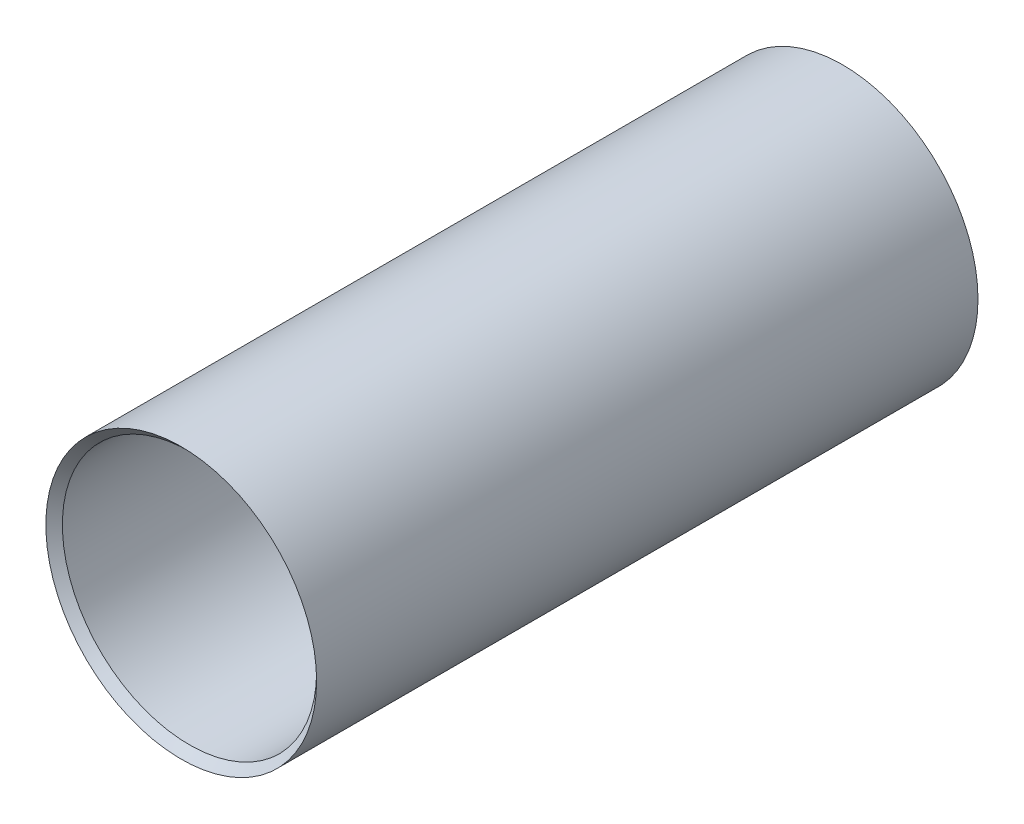
ISO-10303-21;
HEADER;
FILE_DESCRIPTION(('STEP AP214'),'2;1');
FILE_NAME('part.step','',(''),(''),'','','');
FILE_SCHEMA(('AUTOMOTIVE_DESIGN { 1 0 10303 214 1 1 1 1 }'));
ENDSEC;
DATA;
#1=APPLICATION_CONTEXT('core data for automotive mechanical design processes');
#2=APPLICATION_PROTOCOL_DEFINITION('international standard','automotive_design',2000,#1);
#3=PRODUCT_CONTEXT('',#1,'mechanical');
#4=PRODUCT('Part','Part','',(#3));
#5=PRODUCT_RELATED_PRODUCT_CATEGORY('part','',(#4));
#6=PRODUCT_DEFINITION_FORMATION('','',#4);
#7=PRODUCT_DEFINITION_CONTEXT('part definition',#1,'design');
#8=PRODUCT_DEFINITION('design','',#6,#7);
#9=PRODUCT_DEFINITION_SHAPE('','',#8);
#10=(LENGTH_UNIT() NAMED_UNIT(*) SI_UNIT(.MILLI.,.METRE.));
#11=(NAMED_UNIT(*) PLANE_ANGLE_UNIT() SI_UNIT($,.RADIAN.));
#12=(NAMED_UNIT(*) SI_UNIT($,.STERADIAN.) SOLID_ANGLE_UNIT());
#13=UNCERTAINTY_MEASURE_WITH_UNIT(LENGTH_MEASURE(1.E-05),#10,'distance_accuracy_value','');
#14=(GEOMETRIC_REPRESENTATION_CONTEXT(3) GLOBAL_UNCERTAINTY_ASSIGNED_CONTEXT((#13)) GLOBAL_UNIT_ASSIGNED_CONTEXT((#10,
#11,#12)) REPRESENTATION_CONTEXT('',''));
#15=CARTESIAN_POINT('',(0.,0.,0.));
#16=DIRECTION('',(0.,0.,1.));
#17=DIRECTION('',(1.,0.,0.));
#18=AXIS2_PLACEMENT_3D('',#15,#16,#17);
#19=CARTESIAN_POINT('',(0.,0.,-80.75));
#20=DIRECTION('',(0.,0.,1.));
#21=DIRECTION('',(1.,0.,0.));
#22=AXIS2_PLACEMENT_3D('',#19,#20,#21);
#23=CYLINDRICAL_SURFACE('',#22,32.75);
#24=CARTESIAN_POINT('',(0.,0.,-80.75));
#25=DIRECTION('',(0.,0.,1.));
#26=DIRECTION('',(1.,0.,0.));
#27=AXIS2_PLACEMENT_3D('',#24,#25,#26);
#28=CIRCLE('',#27,32.75);
#29=CARTESIAN_POINT('',(32.75,0.,-80.75));
#30=VERTEX_POINT('',#29);
#31=EDGE_CURVE('E45',#30,#30,#28,.T.);
#32=ORIENTED_EDGE('',*,*,#31,.T.);
#33=EDGE_LOOP('',(#32));
#34=FACE_BOUND('',#33,.T.);
#35=CARTESIAN_POINT('',(0.,0.,79.25));
#36=DIRECTION('',(0.,0.,1.));
#37=DIRECTION('',(1.,0.,0.));
#38=AXIS2_PLACEMENT_3D('',#35,#36,#37);
#39=CIRCLE('',#38,32.75);
#40=CARTESIAN_POINT('',(32.75,0.,79.25));
#41=VERTEX_POINT('',#40);
#42=EDGE_CURVE('E59',#41,#41,#39,.F.);
#43=ORIENTED_EDGE('',*,*,#42,.T.);
#44=EDGE_LOOP('',(#43));
#45=FACE_BOUND('',#44,.T.);
#46=ADVANCED_FACE('F37',(#34,#45),#23,.T.);
#47=CARTESIAN_POINT('',(0.,0.,-80.75));
#48=DIRECTION('',(0.,0.,1.));
#49=DIRECTION('',(1.,0.,0.));
#50=AXIS2_PLACEMENT_3D('',#47,#48,#49);
#51=PLANE('',#50);
#52=CARTESIAN_POINT('',(0.,-21.,-80.75));
#53=DIRECTION('',(0.,0.,-1.));
#54=DIRECTION('',(0.,-1.,0.));
#55=AXIS2_PLACEMENT_3D('',#52,#53,#54);
#56=CIRCLE('',#55,3.);
#57=CARTESIAN_POINT('',(0.,-24.,-80.75));
#58=VERTEX_POINT('',#57);
#59=EDGE_CURVE('E112',#58,#58,#56,.T.);
#60=ORIENTED_EDGE('',*,*,#59,.F.);
#61=EDGE_LOOP('',(#60));
#62=FACE_BOUND('',#61,.T.);
#63=CARTESIAN_POINT('',(21.,0.,-80.75));
#64=DIRECTION('',(0.,0.,-1.));
#65=DIRECTION('',(1.,0.,0.));
#66=AXIS2_PLACEMENT_3D('',#63,#64,#65);
#67=CIRCLE('',#66,3.);
#68=CARTESIAN_POINT('',(24.,0.,-80.75));
#69=VERTEX_POINT('',#68);
#70=EDGE_CURVE('E120',#69,#69,#67,.T.);
#71=ORIENTED_EDGE('',*,*,#70,.F.);
#72=EDGE_LOOP('',(#71));
#73=FACE_BOUND('',#72,.T.);
#74=CARTESIAN_POINT('',(-2.19963324347117E-13,21.,-80.75));
#75=DIRECTION('',(0.,0.,-1.));
#76=DIRECTION('',(0.,1.,0.));
#77=AXIS2_PLACEMENT_3D('',#74,#75,#76);
#78=CIRCLE('',#77,3.);
#79=CARTESIAN_POINT('',(-2.51386656396706E-13,24.,-80.75));
#80=VERTEX_POINT('',#79);
#81=EDGE_CURVE('E62',#80,#80,#78,.T.);
#82=ORIENTED_EDGE('',*,*,#81,.F.);
#83=EDGE_LOOP('',(#82));
#84=FACE_BOUND('',#83,.T.);
#85=CARTESIAN_POINT('',(-21.,0.,-80.75));
#86=DIRECTION('',(0.,0.,-1.));
#87=DIRECTION('',(-1.,0.,0.));
#88=AXIS2_PLACEMENT_3D('',#85,#86,#87);
#89=CIRCLE('',#88,3.);
#90=CARTESIAN_POINT('',(-24.,0.,-80.75));
#91=VERTEX_POINT('',#90);
#92=EDGE_CURVE('E56',#91,#91,#89,.T.);
#93=ORIENTED_EDGE('',*,*,#92,.F.);
#94=EDGE_LOOP('',(#93));
#95=FACE_BOUND('',#94,.T.);
#96=ORIENTED_EDGE('',*,*,#31,.F.);
#97=EDGE_LOOP('',(#96));
#98=FACE_BOUND('',#97,.T.);
#99=ADVANCED_FACE('F137',(#62,#73,#84,#95,#98),#51,.F.);
#100=CARTESIAN_POINT('',(-21.,0.,-70.75));
#101=DIRECTION('',(0.,0.,-1.));
#102=DIRECTION('',(-1.,0.,0.));
#103=AXIS2_PLACEMENT_3D('',#100,#101,#102);
#104=CYLINDRICAL_SURFACE('',#103,3.);
#105=CARTESIAN_POINT('',(-21.,0.,-70.75));
#106=DIRECTION('',(0.,0.,-1.));
#107=DIRECTION('',(-1.,0.,0.));
#108=AXIS2_PLACEMENT_3D('',#105,#106,#107);
#109=CIRCLE('',#108,3.);
#110=CARTESIAN_POINT('',(-24.,0.,-70.75));
#111=VERTEX_POINT('',#110);
#112=EDGE_CURVE('E50',#111,#111,#109,.T.);
#113=ORIENTED_EDGE('',*,*,#112,.F.);
#114=EDGE_LOOP('',(#113));
#115=FACE_BOUND('',#114,.T.);
#116=ORIENTED_EDGE('',*,*,#92,.T.);
#117=EDGE_LOOP('',(#116));
#118=FACE_BOUND('',#117,.T.);
#119=ADVANCED_FACE('F140',(#115,#118),#104,.F.);
#120=CARTESIAN_POINT('',(-21.,0.,-70.75));
#121=DIRECTION('',(0.,0.,-1.));
#122=DIRECTION('',(-1.,0.,0.));
#123=AXIS2_PLACEMENT_3D('',#120,#121,#122);
#124=PLANE('',#123);
#125=ORIENTED_EDGE('',*,*,#112,.T.);
#126=EDGE_LOOP('',(#125));
#127=FACE_BOUND('',#126,.T.);
#128=ADVANCED_FACE('F133',(#127),#124,.T.);
#129=CARTESIAN_POINT('',(-2.19963324347117E-13,21.,-70.75));
#130=DIRECTION('',(0.,0.,-1.));
#131=DIRECTION('',(-1.,0.,0.));
#132=AXIS2_PLACEMENT_3D('',#129,#130,#131);
#133=CYLINDRICAL_SURFACE('',#132,3.);
#134=CARTESIAN_POINT('',(-2.19963324347117E-13,21.,-70.75));
#135=DIRECTION('',(0.,0.,-1.));
#136=DIRECTION('',(0.,1.,0.));
#137=AXIS2_PLACEMENT_3D('',#134,#135,#136);
#138=CIRCLE('',#137,3.);
#139=CARTESIAN_POINT('',(-2.51386656396706E-13,24.,-70.75));
#140=VERTEX_POINT('',#139);
#141=EDGE_CURVE('E69',#140,#140,#138,.T.);
#142=ORIENTED_EDGE('',*,*,#141,.F.);
#143=EDGE_LOOP('',(#142));
#144=FACE_BOUND('',#143,.T.);
#145=ORIENTED_EDGE('',*,*,#81,.T.);
#146=EDGE_LOOP('',(#145));
#147=FACE_BOUND('',#146,.T.);
#148=ADVANCED_FACE('F130',(#144,#147),#133,.F.);
#149=CARTESIAN_POINT('',(-2.19963324347117E-13,21.,-70.75));
#150=DIRECTION('',(0.,0.,-1.));
#151=DIRECTION('',(0.,1.,0.));
#152=AXIS2_PLACEMENT_3D('',#149,#150,#151);
#153=PLANE('',#152);
#154=ORIENTED_EDGE('',*,*,#141,.T.);
#155=EDGE_LOOP('',(#154));
#156=FACE_BOUND('',#155,.T.);
#157=ADVANCED_FACE('F128',(#156),#153,.T.);
#158=CARTESIAN_POINT('',(21.,0.,-70.75));
#159=DIRECTION('',(0.,0.,-1.));
#160=DIRECTION('',(-1.,0.,0.));
#161=AXIS2_PLACEMENT_3D('',#158,#159,#160);
#162=CYLINDRICAL_SURFACE('',#161,3.);
#163=CARTESIAN_POINT('',(21.,0.,-70.75));
#164=DIRECTION('',(0.,0.,-1.));
#165=DIRECTION('',(1.,0.,0.));
#166=AXIS2_PLACEMENT_3D('',#163,#164,#165);
#167=CIRCLE('',#166,3.);
#168=CARTESIAN_POINT('',(24.,0.,-70.75));
#169=VERTEX_POINT('',#168);
#170=EDGE_CURVE('E116',#169,#169,#167,.T.);
#171=ORIENTED_EDGE('',*,*,#170,.F.);
#172=EDGE_LOOP('',(#171));
#173=FACE_BOUND('',#172,.T.);
#174=ORIENTED_EDGE('',*,*,#70,.T.);
#175=EDGE_LOOP('',(#174));
#176=FACE_BOUND('',#175,.T.);
#177=ADVANCED_FACE('F185',(#173,#176),#162,.F.);
#178=CARTESIAN_POINT('',(21.,0.,-70.75));
#179=DIRECTION('',(0.,0.,-1.));
#180=DIRECTION('',(1.,0.,0.));
#181=AXIS2_PLACEMENT_3D('',#178,#179,#180);
#182=PLANE('',#181);
#183=ORIENTED_EDGE('',*,*,#170,.T.);
#184=EDGE_LOOP('',(#183));
#185=FACE_BOUND('',#184,.T.);
#186=ADVANCED_FACE('F194',(#185),#182,.T.);
#187=CARTESIAN_POINT('',(0.,-21.,-70.75));
#188=DIRECTION('',(0.,0.,-1.));
#189=DIRECTION('',(-1.,0.,0.));
#190=AXIS2_PLACEMENT_3D('',#187,#188,#189);
#191=CYLINDRICAL_SURFACE('',#190,3.);
#192=CARTESIAN_POINT('',(0.,-21.,-70.75));
#193=DIRECTION('',(0.,0.,-1.));
#194=DIRECTION('',(0.,-1.,0.));
#195=AXIS2_PLACEMENT_3D('',#192,#193,#194);
#196=CIRCLE('',#195,3.);
#197=CARTESIAN_POINT('',(0.,-24.,-70.75));
#198=VERTEX_POINT('',#197);
#199=EDGE_CURVE('E108',#198,#198,#196,.T.);
#200=ORIENTED_EDGE('',*,*,#199,.F.);
#201=EDGE_LOOP('',(#200));
#202=FACE_BOUND('',#201,.T.);
#203=ORIENTED_EDGE('',*,*,#59,.T.);
#204=EDGE_LOOP('',(#203));
#205=FACE_BOUND('',#204,.T.);
#206=ADVANCED_FACE('F204',(#202,#205),#191,.F.);
#207=CARTESIAN_POINT('',(0.,-21.,-70.75));
#208=DIRECTION('',(0.,0.,-1.));
#209=DIRECTION('',(0.,-1.,0.));
#210=AXIS2_PLACEMENT_3D('',#207,#208,#209);
#211=PLANE('',#210);
#212=ORIENTED_EDGE('',*,*,#199,.T.);
#213=EDGE_LOOP('',(#212));
#214=FACE_BOUND('',#213,.T.);
#215=ADVANCED_FACE('F213',(#214),#211,.T.);
#216=CARTESIAN_POINT('',(0.,0.,-80.75));
#217=DIRECTION('',(0.,0.,1.));
#218=DIRECTION('',(1.,0.,0.));
#219=AXIS2_PLACEMENT_3D('',#216,#217,#218);
#220=CYLINDRICAL_SURFACE('',#219,30.75);
#221=CARTESIAN_POINT('',(0.,0.,77.25));
#222=DIRECTION('',(0.,0.,1.));
#223=DIRECTION('',(1.,0.,0.));
#224=AXIS2_PLACEMENT_3D('',#221,#222,#223);
#225=CIRCLE('',#224,30.75);
#226=CARTESIAN_POINT('',(30.75,0.,77.25));
#227=VERTEX_POINT('',#226);
#228=EDGE_CURVE('E10',#227,#227,#225,.T.);
#229=ORIENTED_EDGE('',*,*,#228,.T.);
#230=EDGE_LOOP('',(#229));
#231=FACE_BOUND('',#230,.T.);
#232=CARTESIAN_POINT('',(0.,0.,-78.75));
#233=DIRECTION('',(0.,0.,1.));
#234=DIRECTION('',(1.,0.,0.));
#235=AXIS2_PLACEMENT_3D('',#232,#233,#234);
#236=CIRCLE('',#235,30.75);
#237=CARTESIAN_POINT('',(30.75,0.,-78.75));
#238=VERTEX_POINT('',#237);
#239=EDGE_CURVE('E63',#238,#238,#236,.T.);
#240=ORIENTED_EDGE('',*,*,#239,.F.);
#241=EDGE_LOOP('',(#240));
#242=FACE_BOUND('',#241,.T.);
#243=ADVANCED_FACE('F222',(#231,#242),#220,.F.);
#244=CARTESIAN_POINT('',(0.,0.,-78.75));
#245=DIRECTION('',(0.,0.,1.));
#246=DIRECTION('',(1.,0.,0.));
#247=AXIS2_PLACEMENT_3D('',#244,#245,#246);
#248=PLANE('',#247);
#249=CARTESIAN_POINT('',(0.,-21.,-78.75));
#250=DIRECTION('',(0.,0.,1.));
#251=DIRECTION('',(1.,0.,0.));
#252=AXIS2_PLACEMENT_3D('',#249,#250,#251);
#253=CIRCLE('',#252,5.);
#254=CARTESIAN_POINT('',(5.00000000000007,-21.,-78.75));
#255=VERTEX_POINT('',#254);
#256=EDGE_CURVE('E81',#255,#255,#253,.F.);
#257=ORIENTED_EDGE('',*,*,#256,.T.);
#258=EDGE_LOOP('',(#257));
#259=FACE_BOUND('',#258,.T.);
#260=CARTESIAN_POINT('',(21.,0.,-78.75));
#261=DIRECTION('',(0.,0.,1.));
#262=DIRECTION('',(1.,0.,0.));
#263=AXIS2_PLACEMENT_3D('',#260,#261,#262);
#264=CIRCLE('',#263,5.);
#265=CARTESIAN_POINT('',(26.,0.,-78.75));
#266=VERTEX_POINT('',#265);
#267=EDGE_CURVE('E87',#266,#266,#264,.F.);
#268=ORIENTED_EDGE('',*,*,#267,.T.);
#269=EDGE_LOOP('',(#268));
#270=FACE_BOUND('',#269,.T.);
#271=CARTESIAN_POINT('',(-2.19963324347117E-13,21.,-78.75));
#272=DIRECTION('',(0.,0.,1.));
#273=DIRECTION('',(1.,0.,0.));
#274=AXIS2_PLACEMENT_3D('',#271,#272,#273);
#275=CIRCLE('',#274,5.);
#276=CARTESIAN_POINT('',(4.99999999999978,21.,-78.75));
#277=VERTEX_POINT('',#276);
#278=EDGE_CURVE('E92',#277,#277,#275,.F.);
#279=ORIENTED_EDGE('',*,*,#278,.T.);
#280=EDGE_LOOP('',(#279));
#281=FACE_BOUND('',#280,.T.);
#282=CARTESIAN_POINT('',(-21.,0.,-78.75));
#283=DIRECTION('',(0.,0.,1.));
#284=DIRECTION('',(1.,0.,0.));
#285=AXIS2_PLACEMENT_3D('',#282,#283,#284);
#286=CIRCLE('',#285,5.);
#287=CARTESIAN_POINT('',(-16.,0.,-78.75));
#288=VERTEX_POINT('',#287);
#289=EDGE_CURVE('E78',#288,#288,#286,.F.);
#290=ORIENTED_EDGE('',*,*,#289,.T.);
#291=EDGE_LOOP('',(#290));
#292=FACE_BOUND('',#291,.T.);
#293=ORIENTED_EDGE('',*,*,#239,.T.);
#294=EDGE_LOOP('',(#293));
#295=FACE_BOUND('',#294,.T.);
#296=ADVANCED_FACE('F232',(#259,#270,#281,#292,#295),#248,.T.);
#297=CARTESIAN_POINT('',(-21.,0.,-70.75));
#298=DIRECTION('',(0.,0.,-1.));
#299=DIRECTION('',(-1.,0.,0.));
#300=AXIS2_PLACEMENT_3D('',#297,#298,#299);
#301=CYLINDRICAL_SURFACE('',#300,5.);
#302=CARTESIAN_POINT('',(-21.,0.,-68.75));
#303=DIRECTION('',(0.,0.,-1.));
#304=DIRECTION('',(-1.,0.,0.));
#305=AXIS2_PLACEMENT_3D('',#302,#303,#304);
#306=CIRCLE('',#305,5.);
#307=CARTESIAN_POINT('',(-26.,0.,-68.75));
#308=VERTEX_POINT('',#307);
#309=EDGE_CURVE('E72',#308,#308,#306,.T.);
#310=ORIENTED_EDGE('',*,*,#309,.T.);
#311=EDGE_LOOP('',(#310));
#312=FACE_BOUND('',#311,.T.);
#313=ORIENTED_EDGE('',*,*,#289,.F.);
#314=EDGE_LOOP('',(#313));
#315=FACE_BOUND('',#314,.T.);
#316=ADVANCED_FACE('F240',(#312,#315),#301,.T.);
#317=CARTESIAN_POINT('',(-21.,0.,-68.75));
#318=DIRECTION('',(0.,0.,-1.));
#319=DIRECTION('',(-1.,0.,0.));
#320=AXIS2_PLACEMENT_3D('',#317,#318,#319);
#321=PLANE('',#320);
#322=ORIENTED_EDGE('',*,*,#309,.F.);
#323=EDGE_LOOP('',(#322));
#324=FACE_BOUND('',#323,.T.);
#325=ADVANCED_FACE('F248',(#324),#321,.F.);
#326=CARTESIAN_POINT('',(-2.19963324347117E-13,21.,-70.75));
#327=DIRECTION('',(0.,0.,-1.));
#328=DIRECTION('',(-1.,0.,0.));
#329=AXIS2_PLACEMENT_3D('',#326,#327,#328);
#330=CYLINDRICAL_SURFACE('',#329,5.);
#331=CARTESIAN_POINT('',(-2.19963324347117E-13,21.,-68.75));
#332=DIRECTION('',(0.,0.,-1.));
#333=DIRECTION('',(-1.,0.,0.));
#334=AXIS2_PLACEMENT_3D('',#331,#332,#333);
#335=CIRCLE('',#334,5.);
#336=CARTESIAN_POINT('',(-5.00000000000022,21.,-68.75));
#337=VERTEX_POINT('',#336);
#338=EDGE_CURVE('E91',#337,#337,#335,.T.);
#339=ORIENTED_EDGE('',*,*,#338,.T.);
#340=EDGE_LOOP('',(#339));
#341=FACE_BOUND('',#340,.T.);
#342=ORIENTED_EDGE('',*,*,#278,.F.);
#343=EDGE_LOOP('',(#342));
#344=FACE_BOUND('',#343,.T.);
#345=ADVANCED_FACE('F256',(#341,#344),#330,.T.);
#346=CARTESIAN_POINT('',(-2.19963324347117E-13,21.,-68.75));
#347=DIRECTION('',(0.,0.,-1.));
#348=DIRECTION('',(0.,1.,0.));
#349=AXIS2_PLACEMENT_3D('',#346,#347,#348);
#350=PLANE('',#349);
#351=ORIENTED_EDGE('',*,*,#338,.F.);
#352=EDGE_LOOP('',(#351));
#353=FACE_BOUND('',#352,.T.);
#354=ADVANCED_FACE('F264',(#353),#350,.F.);
#355=CARTESIAN_POINT('',(21.,0.,-70.75));
#356=DIRECTION('',(0.,0.,-1.));
#357=DIRECTION('',(-1.,0.,0.));
#358=AXIS2_PLACEMENT_3D('',#355,#356,#357);
#359=CYLINDRICAL_SURFACE('',#358,5.);
#360=CARTESIAN_POINT('',(21.,0.,-68.75));
#361=DIRECTION('',(0.,0.,-1.));
#362=DIRECTION('',(-1.,0.,0.));
#363=AXIS2_PLACEMENT_3D('',#360,#361,#362);
#364=CIRCLE('',#363,5.);
#365=CARTESIAN_POINT('',(16.,0.,-68.75));
#366=VERTEX_POINT('',#365);
#367=EDGE_CURVE('E86',#366,#366,#364,.T.);
#368=ORIENTED_EDGE('',*,*,#367,.T.);
#369=EDGE_LOOP('',(#368));
#370=FACE_BOUND('',#369,.T.);
#371=ORIENTED_EDGE('',*,*,#267,.F.);
#372=EDGE_LOOP('',(#371));
#373=FACE_BOUND('',#372,.T.);
#374=ADVANCED_FACE('F272',(#370,#373),#359,.T.);
#375=CARTESIAN_POINT('',(21.,0.,-68.75));
#376=DIRECTION('',(0.,0.,-1.));
#377=DIRECTION('',(1.,0.,0.));
#378=AXIS2_PLACEMENT_3D('',#375,#376,#377);
#379=PLANE('',#378);
#380=ORIENTED_EDGE('',*,*,#367,.F.);
#381=EDGE_LOOP('',(#380));
#382=FACE_BOUND('',#381,.T.);
#383=ADVANCED_FACE('F280',(#382),#379,.F.);
#384=CARTESIAN_POINT('',(0.,-21.,-70.75));
#385=DIRECTION('',(0.,0.,-1.));
#386=DIRECTION('',(-1.,0.,0.));
#387=AXIS2_PLACEMENT_3D('',#384,#385,#386);
#388=CYLINDRICAL_SURFACE('',#387,5.);
#389=CARTESIAN_POINT('',(0.,-21.,-68.75));
#390=DIRECTION('',(0.,0.,-1.));
#391=DIRECTION('',(-1.,0.,0.));
#392=AXIS2_PLACEMENT_3D('',#389,#390,#391);
#393=CIRCLE('',#392,5.);
#394=CARTESIAN_POINT('',(-4.99999999999992,-21.,-68.75));
#395=VERTEX_POINT('',#394);
#396=EDGE_CURVE('E85',#395,#395,#393,.T.);
#397=ORIENTED_EDGE('',*,*,#396,.T.);
#398=EDGE_LOOP('',(#397));
#399=FACE_BOUND('',#398,.T.);
#400=ORIENTED_EDGE('',*,*,#256,.F.);
#401=EDGE_LOOP('',(#400));
#402=FACE_BOUND('',#401,.T.);
#403=ADVANCED_FACE('F288',(#399,#402),#388,.T.);
#404=CARTESIAN_POINT('',(0.,-21.,-68.75));
#405=DIRECTION('',(0.,0.,-1.));
#406=DIRECTION('',(0.,-1.,0.));
#407=AXIS2_PLACEMENT_3D('',#404,#405,#406);
#408=PLANE('',#407);
#409=ORIENTED_EDGE('',*,*,#396,.F.);
#410=EDGE_LOOP('',(#409));
#411=FACE_BOUND('',#410,.T.);
#412=ADVANCED_FACE('F296',(#411),#408,.F.);
#413=CARTESIAN_POINT('',(0.,0.,79.25));
#414=DIRECTION('',(0.,0.,1.));
#415=DIRECTION('',(1.,0.,0.));
#416=AXIS2_PLACEMENT_3D('',#413,#414,#415);
#417=CONICAL_SURFACE('',#416,32.75,0.785398163397443);
#418=ORIENTED_EDGE('',*,*,#228,.F.);
#419=EDGE_LOOP('',(#418));
#420=FACE_BOUND('',#419,.T.);
#421=ORIENTED_EDGE('',*,*,#42,.F.);
#422=EDGE_LOOP('',(#421));
#423=FACE_BOUND('',#422,.T.);
#424=ADVANCED_FACE('F39',(#420,#423),#417,.F.);
#425=CLOSED_SHELL('',(#46,#99,#119,#128,#148,#157,#177,#186,#206,#215,#243,#296,#316,#325,#345,
#354,#374,#383,#403,#412,#424));
#426=MANIFOLD_SOLID_BREP('B2',#425);
#427=ADVANCED_BREP_SHAPE_REPRESENTATION('',(#18,#426),#14);
#428=SHAPE_DEFINITION_REPRESENTATION(#9,#427);
ENDSEC;
END-ISO-10303-21;
